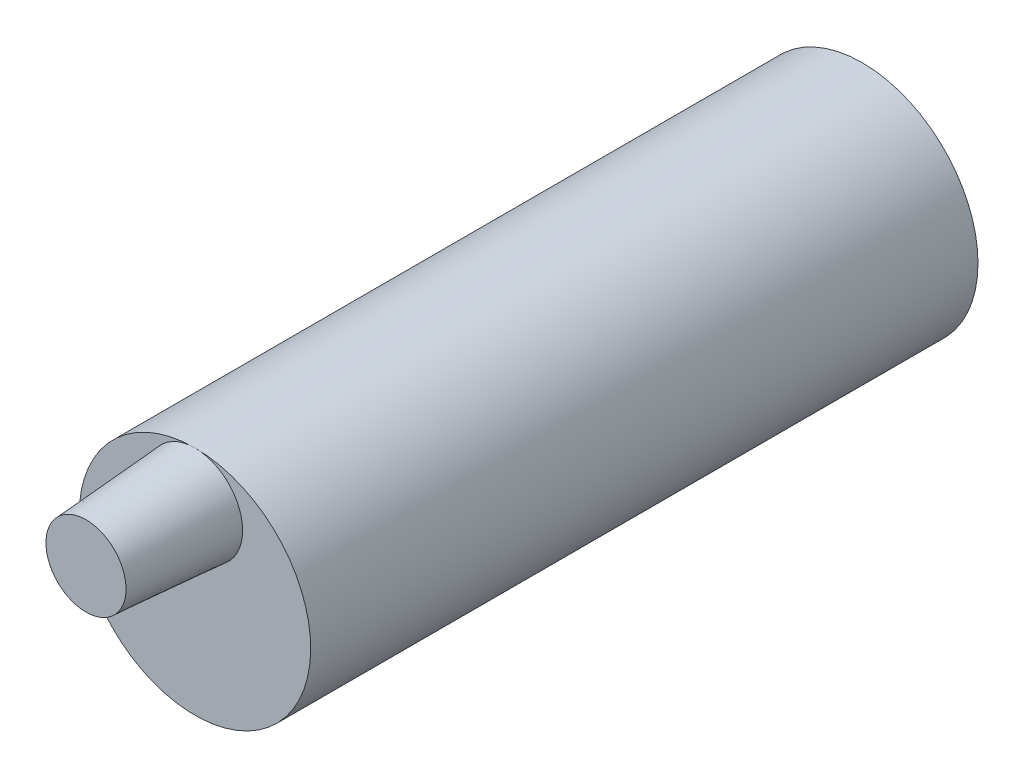
ISO-10303-21;
HEADER;
FILE_DESCRIPTION(('STEP AP214'),'2;1');
FILE_NAME('part.step','',(''),(''),'','','');
FILE_SCHEMA(('AUTOMOTIVE_DESIGN { 1 0 10303 214 1 1 1 1 }'));
ENDSEC;
DATA;
#1=APPLICATION_CONTEXT('core data for automotive mechanical design processes');
#2=APPLICATION_PROTOCOL_DEFINITION('international standard','automotive_design',2000,#1);
#3=PRODUCT_CONTEXT('',#1,'mechanical');
#4=PRODUCT('Part','Part','',(#3));
#5=PRODUCT_RELATED_PRODUCT_CATEGORY('part','',(#4));
#6=PRODUCT_DEFINITION_FORMATION('','',#4);
#7=PRODUCT_DEFINITION_CONTEXT('part definition',#1,'design');
#8=PRODUCT_DEFINITION('design','',#6,#7);
#9=PRODUCT_DEFINITION_SHAPE('','',#8);
#10=(LENGTH_UNIT() NAMED_UNIT(*) SI_UNIT(.MILLI.,.METRE.));
#11=(NAMED_UNIT(*) PLANE_ANGLE_UNIT() SI_UNIT($,.RADIAN.));
#12=(NAMED_UNIT(*) SI_UNIT($,.STERADIAN.) SOLID_ANGLE_UNIT());
#13=UNCERTAINTY_MEASURE_WITH_UNIT(LENGTH_MEASURE(1.E-05),#10,'distance_accuracy_value','');
#14=(GEOMETRIC_REPRESENTATION_CONTEXT(3) GLOBAL_UNCERTAINTY_ASSIGNED_CONTEXT((#13)) GLOBAL_UNIT_ASSIGNED_CONTEXT((#10,
#11,#12)) REPRESENTATION_CONTEXT('',''));
#15=CARTESIAN_POINT('',(0.,0.,0.));
#16=DIRECTION('',(0.,0.,1.));
#17=DIRECTION('',(1.,0.,0.));
#18=AXIS2_PLACEMENT_3D('',#15,#16,#17);
#19=CARTESIAN_POINT('',(0.,0.,49.));
#20=DIRECTION('',(0.,0.,-1.));
#21=DIRECTION('',(-1.,0.,0.));
#22=AXIS2_PLACEMENT_3D('',#19,#20,#21);
#23=CYLINDRICAL_SURFACE('',#22,8.5);
#24=CARTESIAN_POINT('',(0.,0.,49.));
#25=DIRECTION('',(0.,0.,1.));
#26=DIRECTION('',(1.,0.,0.));
#27=AXIS2_PLACEMENT_3D('',#24,#25,#26);
#28=CIRCLE('',#27,8.5);
#29=CARTESIAN_POINT('',(0.,8.5,49.));
#30=VERTEX_POINT('',#29);
#31=EDGE_CURVE('E11',#30,#30,#28,.T.);
#32=ORIENTED_EDGE('',*,*,#31,.F.);
#33=EDGE_LOOP('',(#32));
#34=FACE_BOUND('',#33,.T.);
#35=CARTESIAN_POINT('',(0.,0.,0.));
#36=DIRECTION('',(0.,0.,1.));
#37=DIRECTION('',(1.,0.,0.));
#38=AXIS2_PLACEMENT_3D('',#35,#36,#37);
#39=CIRCLE('',#38,8.5);
#40=CARTESIAN_POINT('',(8.5,0.,0.));
#41=VERTEX_POINT('',#40);
#42=EDGE_CURVE('E42',#41,#41,#39,.T.);
#43=ORIENTED_EDGE('',*,*,#42,.T.);
#44=EDGE_LOOP('',(#43));
#45=FACE_BOUND('',#44,.T.);
#46=ADVANCED_FACE('F39',(#34,#45),#23,.T.);
#47=CARTESIAN_POINT('',(0.,0.,49.));
#48=DIRECTION('',(0.,0.,1.));
#49=DIRECTION('',(1.,0.,0.));
#50=AXIS2_PLACEMENT_3D('',#47,#48,#49);
#51=PLANE('',#50);
#52=ORIENTED_EDGE('',*,*,#31,.T.);
#53=CARTESIAN_POINT('',(0.,5.,49.));
#54=DIRECTION('',(0.,0.,1.));
#55=DIRECTION('',(1.,0.,0.));
#56=AXIS2_PLACEMENT_3D('',#53,#54,#55);
#57=CIRCLE('',#56,3.5);
#58=EDGE_CURVE('E54',#30,#30,#57,.T.);
#59=ORIENTED_EDGE('',*,*,#58,.F.);
#60=EDGE_LOOP('',(#52,#59));
#61=FACE_BOUND('',#60,.T.);
#62=ADVANCED_FACE('F52',(#61),#51,.T.);
#63=CARTESIAN_POINT('',(0.,0.,0.));
#64=DIRECTION('',(0.,0.,1.));
#65=DIRECTION('',(1.,0.,0.));
#66=AXIS2_PLACEMENT_3D('',#63,#64,#65);
#67=PLANE('',#66);
#68=ORIENTED_EDGE('',*,*,#42,.F.);
#69=EDGE_LOOP('',(#68));
#70=FACE_BOUND('',#69,.T.);
#71=ADVANCED_FACE('F68',(#70),#67,.F.);
#72=CARTESIAN_POINT('',(0.,5.,49.));
#73=DIRECTION('',(0.,0.,-1.));
#74=DIRECTION('',(1.,0.,0.));
#75=AXIS2_PLACEMENT_3D('',#72,#73,#74);
#76=CONICAL_SURFACE('',#75,3.5,0.0698131700797733);
#77=CARTESIAN_POINT('',(0.,5.,57.));
#78=DIRECTION('',(0.,0.,1.));
#79=DIRECTION('',(1.,0.,0.));
#80=AXIS2_PLACEMENT_3D('',#77,#78,#79);
#81=CIRCLE('',#80,2.94058550445192);
#82=CARTESIAN_POINT('',(2.94058550445192,5.,57.));
#83=VERTEX_POINT('',#82);
#84=EDGE_CURVE('E57',#83,#83,#81,.T.);
#85=ORIENTED_EDGE('',*,*,#84,.F.);
#86=EDGE_LOOP('',(#85));
#87=FACE_BOUND('',#86,.T.);
#88=ORIENTED_EDGE('',*,*,#58,.T.);
#89=EDGE_LOOP('',(#88));
#90=FACE_BOUND('',#89,.T.);
#91=ADVANCED_FACE('F70',(#87,#90),#76,.T.);
#92=CARTESIAN_POINT('',(0.,5.,57.));
#93=DIRECTION('',(0.,0.,1.));
#94=DIRECTION('',(1.,0.,0.));
#95=AXIS2_PLACEMENT_3D('',#92,#93,#94);
#96=PLANE('',#95);
#97=ORIENTED_EDGE('',*,*,#84,.T.);
#98=EDGE_LOOP('',(#97));
#99=FACE_BOUND('',#98,.T.);
#100=ADVANCED_FACE('F75',(#99),#96,.T.);
#101=CLOSED_SHELL('',(#46,#62,#71,#91,#100));
#102=MANIFOLD_SOLID_BREP('B2',#101);
#103=ADVANCED_BREP_SHAPE_REPRESENTATION('',(#18,#102),#14);
#104=SHAPE_DEFINITION_REPRESENTATION(#9,#103);
ENDSEC;
END-ISO-10303-21;
